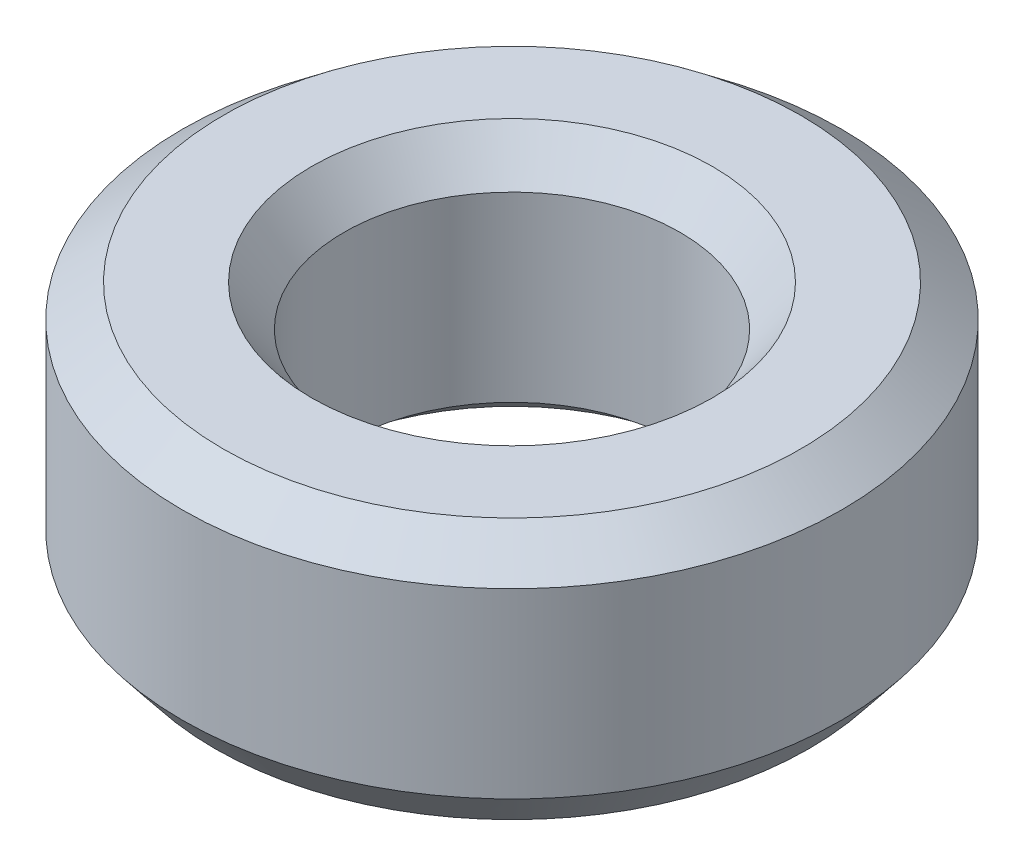
ISO-10303-21;
HEADER;
FILE_DESCRIPTION(('STEP AP214'),'2;1');
FILE_NAME('part.step','',(''),(''),'','','');
FILE_SCHEMA(('AUTOMOTIVE_DESIGN { 1 0 10303 214 1 1 1 1 }'));
ENDSEC;
DATA;
#1=APPLICATION_CONTEXT('core data for automotive mechanical design processes');
#2=APPLICATION_PROTOCOL_DEFINITION('international standard','automotive_design',2000,#1);
#3=PRODUCT_CONTEXT('',#1,'mechanical');
#4=PRODUCT('Part','Part','',(#3));
#5=PRODUCT_RELATED_PRODUCT_CATEGORY('part','',(#4));
#6=PRODUCT_DEFINITION_FORMATION('','',#4);
#7=PRODUCT_DEFINITION_CONTEXT('part definition',#1,'design');
#8=PRODUCT_DEFINITION('design','',#6,#7);
#9=PRODUCT_DEFINITION_SHAPE('','',#8);
#10=(LENGTH_UNIT() NAMED_UNIT(*) SI_UNIT(.MILLI.,.METRE.));
#11=(NAMED_UNIT(*) PLANE_ANGLE_UNIT() SI_UNIT($,.RADIAN.));
#12=(NAMED_UNIT(*) SI_UNIT($,.STERADIAN.) SOLID_ANGLE_UNIT());
#13=UNCERTAINTY_MEASURE_WITH_UNIT(LENGTH_MEASURE(1.E-05),#10,'distance_accuracy_value','');
#14=(GEOMETRIC_REPRESENTATION_CONTEXT(3) GLOBAL_UNCERTAINTY_ASSIGNED_CONTEXT((#13)) GLOBAL_UNIT_ASSIGNED_CONTEXT((#10,
#11,#12)) REPRESENTATION_CONTEXT('',''));
#15=CARTESIAN_POINT('',(0.,0.,0.));
#16=DIRECTION('',(0.,0.,1.));
#17=DIRECTION('',(1.,0.,0.));
#18=AXIS2_PLACEMENT_3D('',#15,#16,#17);
#19=CARTESIAN_POINT('',(0.,27.0983703871966,0.));
#20=DIRECTION('',(0.,-1.,0.));
#21=DIRECTION('',(0.,0.,-1.));
#22=AXIS2_PLACEMENT_3D('',#19,#20,#21);
#23=CYLINDRICAL_SURFACE('',#22,35.);
#24=CARTESIAN_POINT('',(0.,4.33378286748394,0.));
#25=DIRECTION('',(0.,1.,0.));
#26=DIRECTION('',(0.,0.,1.));
#27=AXIS2_PLACEMENT_3D('',#24,#25,#26);
#28=CIRCLE('',#27,35.);
#29=CARTESIAN_POINT('',(0.,4.33378286748394,35.));
#30=VERTEX_POINT('',#29);
#31=EDGE_CURVE('E10',#30,#30,#28,.T.);
#32=ORIENTED_EDGE('',*,*,#31,.T.);
#33=EDGE_LOOP('',(#32));
#34=FACE_BOUND('',#33,.T.);
#35=CARTESIAN_POINT('',(0.,23.6596620120184,0.));
#36=DIRECTION('',(0.,1.,0.));
#37=DIRECTION('',(0.,0.,1.));
#38=AXIS2_PLACEMENT_3D('',#35,#36,#37);
#39=CIRCLE('',#38,35.);
#40=CARTESIAN_POINT('',(0.,23.6596620120184,35.));
#41=VERTEX_POINT('',#40);
#42=EDGE_CURVE('E50',#41,#41,#39,.F.);
#43=ORIENTED_EDGE('',*,*,#42,.T.);
#44=EDGE_LOOP('',(#43));
#45=FACE_BOUND('',#44,.T.);
#46=ADVANCED_FACE('F39',(#34,#45),#23,.T.);
#47=CARTESIAN_POINT('',(0.,27.0983703871966,0.));
#48=DIRECTION('',(0.,1.,0.));
#49=DIRECTION('',(0.,0.,1.));
#50=AXIS2_PLACEMENT_3D('',#47,#48,#49);
#51=PLANE('',#50);
#52=CARTESIAN_POINT('',(0.,27.0983703871966,0.));
#53=DIRECTION('',(0.,1.,0.));
#54=DIRECTION('',(0.,0.,1.));
#55=AXIS2_PLACEMENT_3D('',#52,#53,#54);
#56=CIRCLE('',#55,21.2795290062898);
#57=CARTESIAN_POINT('',(0.,27.0983703871966,21.2795290062898));
#58=VERTEX_POINT('',#57);
#59=EDGE_CURVE('E58',#58,#58,#56,.F.);
#60=ORIENTED_EDGE('',*,*,#59,.T.);
#61=EDGE_LOOP('',(#60));
#62=FACE_BOUND('',#61,.T.);
#63=CARTESIAN_POINT('',(0.,27.0983703871966,0.));
#64=DIRECTION('',(0.,1.,0.));
#65=DIRECTION('',(0.,0.,1.));
#66=AXIS2_PLACEMENT_3D('',#63,#64,#65);
#67=CIRCLE('',#66,30.6662171325161);
#68=CARTESIAN_POINT('',(0.,27.0983703871966,30.6662171325161));
#69=VERTEX_POINT('',#68);
#70=EDGE_CURVE('E61',#69,#69,#67,.T.);
#71=ORIENTED_EDGE('',*,*,#70,.T.);
#72=EDGE_LOOP('',(#71));
#73=FACE_BOUND('',#72,.T.);
#74=ADVANCED_FACE('F88',(#62,#73),#51,.T.);
#75=CARTESIAN_POINT('',(0.,0.,0.));
#76=DIRECTION('',(0.,1.,0.));
#77=DIRECTION('',(0.,0.,1.));
#78=AXIS2_PLACEMENT_3D('',#75,#76,#77);
#79=PLANE('',#78);
#80=CARTESIAN_POINT('',(0.,0.,0.));
#81=DIRECTION('',(0.,1.,0.));
#82=DIRECTION('',(0.,0.,1.));
#83=AXIS2_PLACEMENT_3D('',#80,#81,#82);
#84=CIRCLE('',#83,22.1746034985956);
#85=CARTESIAN_POINT('',(0.,0.,22.1746034985956));
#86=VERTEX_POINT('',#85);
#87=EDGE_CURVE('E51',#86,#86,#84,.T.);
#88=ORIENTED_EDGE('',*,*,#87,.T.);
#89=EDGE_LOOP('',(#88));
#90=FACE_BOUND('',#89,.T.);
#91=CARTESIAN_POINT('',(0.,0.,0.));
#92=DIRECTION('',(0.,1.,0.));
#93=DIRECTION('',(0.,0.,1.));
#94=AXIS2_PLACEMENT_3D('',#91,#92,#93);
#95=CIRCLE('',#94,31.5612916248218);
#96=CARTESIAN_POINT('',(0.,0.,31.5612916248218));
#97=VERTEX_POINT('',#96);
#98=EDGE_CURVE('E54',#97,#97,#95,.F.);
#99=ORIENTED_EDGE('',*,*,#98,.T.);
#100=EDGE_LOOP('',(#99));
#101=FACE_BOUND('',#100,.T.);
#102=ADVANCED_FACE('F83',(#90,#101),#79,.F.);
#103=CARTESIAN_POINT('',(0.,27.0983703871966,0.));
#104=DIRECTION('',(0.,-1.,0.));
#105=DIRECTION('',(0.,0.,-1.));
#106=AXIS2_PLACEMENT_3D('',#103,#104,#105);
#107=CYLINDRICAL_SURFACE('',#106,17.8408206311116);
#108=CARTESIAN_POINT('',(0.,22.7645875197127,0.));
#109=DIRECTION('',(0.,1.,0.));
#110=DIRECTION('',(0.,0.,1.));
#111=AXIS2_PLACEMENT_3D('',#108,#109,#110);
#112=CIRCLE('',#111,17.8408206311116);
#113=CARTESIAN_POINT('',(0.,22.7645875197127,17.8408206311116));
#114=VERTEX_POINT('',#113);
#115=EDGE_CURVE('E67',#114,#114,#112,.T.);
#116=ORIENTED_EDGE('',*,*,#115,.T.);
#117=EDGE_LOOP('',(#116));
#118=FACE_BOUND('',#117,.T.);
#119=CARTESIAN_POINT('',(0.,3.43870837517821,0.));
#120=DIRECTION('',(0.,1.,0.));
#121=DIRECTION('',(0.,0.,1.));
#122=AXIS2_PLACEMENT_3D('',#119,#120,#121);
#123=CIRCLE('',#122,17.8408206311116);
#124=CARTESIAN_POINT('',(0.,3.43870837517821,17.8408206311116));
#125=VERTEX_POINT('',#124);
#126=EDGE_CURVE('E69',#125,#125,#123,.F.);
#127=ORIENTED_EDGE('',*,*,#126,.T.);
#128=EDGE_LOOP('',(#127));
#129=FACE_BOUND('',#128,.T.);
#130=ADVANCED_FACE('F71',(#118,#129),#107,.F.);
#131=CARTESIAN_POINT('',(0.,22.7645875197127,0.));
#132=DIRECTION('',(0.,1.,0.));
#133=DIRECTION('',(0.,0.,1.));
#134=AXIS2_PLACEMENT_3D('',#131,#132,#133);
#135=CONICAL_SURFACE('',#134,17.8408206311116,0.670743938838213);
#136=ORIENTED_EDGE('',*,*,#59,.F.);
#137=EDGE_LOOP('',(#136));
#138=FACE_BOUND('',#137,.T.);
#139=ORIENTED_EDGE('',*,*,#115,.F.);
#140=EDGE_LOOP('',(#139));
#141=FACE_BOUND('',#140,.T.);
#142=ADVANCED_FACE('F77',(#138,#141),#135,.F.);
#143=CARTESIAN_POINT('',(0.,0.,0.));
#144=DIRECTION('',(0.,-1.,0.));
#145=DIRECTION('',(0.,0.,-1.));
#146=AXIS2_PLACEMENT_3D('',#143,#144,#145);
#147=CONICAL_SURFACE('',#146,22.1746034985956,0.900052387956682);
#148=ORIENTED_EDGE('',*,*,#126,.F.);
#149=EDGE_LOOP('',(#148));
#150=FACE_BOUND('',#149,.T.);
#151=ORIENTED_EDGE('',*,*,#87,.F.);
#152=EDGE_LOOP('',(#151));
#153=FACE_BOUND('',#152,.T.);
#154=ADVANCED_FACE('F73',(#150,#153),#147,.F.);
#155=CARTESIAN_POINT('',(0.,4.33378286748394,0.));
#156=DIRECTION('',(0.,1.,0.));
#157=DIRECTION('',(0.,0.,1.));
#158=AXIS2_PLACEMENT_3D('',#155,#156,#157);
#159=CONICAL_SURFACE('',#158,35.,0.670743938838214);
#160=ORIENTED_EDGE('',*,*,#98,.F.);
#161=EDGE_LOOP('',(#160));
#162=FACE_BOUND('',#161,.T.);
#163=ORIENTED_EDGE('',*,*,#31,.F.);
#164=EDGE_LOOP('',(#163));
#165=FACE_BOUND('',#164,.T.);
#166=ADVANCED_FACE('F76',(#162,#165),#159,.T.);
#167=CARTESIAN_POINT('',(0.,27.0983703871966,0.));
#168=DIRECTION('',(0.,-1.,0.));
#169=DIRECTION('',(0.,0.,-1.));
#170=AXIS2_PLACEMENT_3D('',#167,#168,#169);
#171=CONICAL_SURFACE('',#170,30.6662171325161,0.900052387956683);
#172=ORIENTED_EDGE('',*,*,#42,.F.);
#173=EDGE_LOOP('',(#172));
#174=FACE_BOUND('',#173,.T.);
#175=ORIENTED_EDGE('',*,*,#70,.F.);
#176=EDGE_LOOP('',(#175));
#177=FACE_BOUND('',#176,.T.);
#178=ADVANCED_FACE('F45',(#174,#177),#171,.T.);
#179=CLOSED_SHELL('',(#46,#74,#102,#130,#142,#154,#166,#178));
#180=MANIFOLD_SOLID_BREP('B2',#179);
#181=ADVANCED_BREP_SHAPE_REPRESENTATION('',(#18,#180),#14);
#182=SHAPE_DEFINITION_REPRESENTATION(#9,#181);
ENDSEC;
END-ISO-10303-21;
